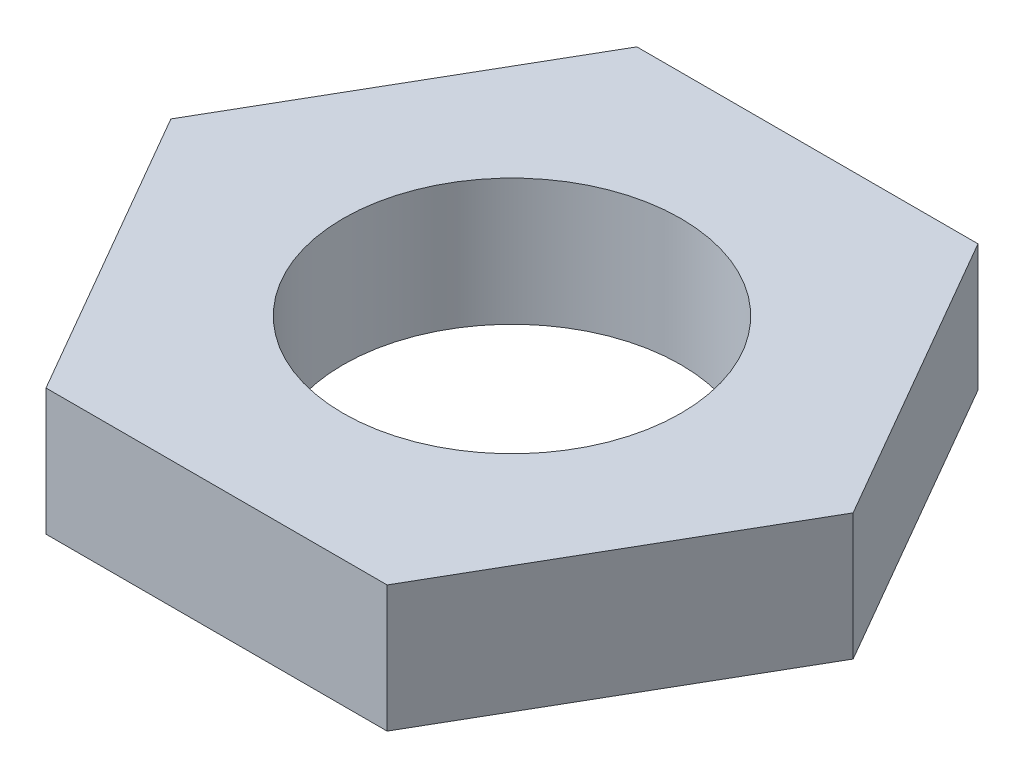
ISO-10303-21;
HEADER;
FILE_DESCRIPTION(('STEP AP214'),'2;1');
FILE_NAME('part.step','',(''),(''),'','','');
FILE_SCHEMA(('AUTOMOTIVE_DESIGN { 1 0 10303 214 1 1 1 1 }'));
ENDSEC;
DATA;
#1=APPLICATION_CONTEXT('core data for automotive mechanical design processes');
#2=APPLICATION_PROTOCOL_DEFINITION('international standard','automotive_design',2000,#1);
#3=PRODUCT_CONTEXT('',#1,'mechanical');
#4=PRODUCT('Part','Part','',(#3));
#5=PRODUCT_RELATED_PRODUCT_CATEGORY('part','',(#4));
#6=PRODUCT_DEFINITION_FORMATION('','',#4);
#7=PRODUCT_DEFINITION_CONTEXT('part definition',#1,'design');
#8=PRODUCT_DEFINITION('design','',#6,#7);
#9=PRODUCT_DEFINITION_SHAPE('','',#8);
#10=(LENGTH_UNIT() NAMED_UNIT(*) SI_UNIT(.MILLI.,.METRE.));
#11=(NAMED_UNIT(*) PLANE_ANGLE_UNIT() SI_UNIT($,.RADIAN.));
#12=(NAMED_UNIT(*) SI_UNIT($,.STERADIAN.) SOLID_ANGLE_UNIT());
#13=UNCERTAINTY_MEASURE_WITH_UNIT(LENGTH_MEASURE(1.E-05),#10,'distance_accuracy_value','');
#14=(GEOMETRIC_REPRESENTATION_CONTEXT(3) GLOBAL_UNCERTAINTY_ASSIGNED_CONTEXT((#13)) GLOBAL_UNIT_ASSIGNED_CONTEXT((#10,
#11,#12)) REPRESENTATION_CONTEXT('',''));
#15=CARTESIAN_POINT('',(0.,0.,0.));
#16=DIRECTION('',(0.,0.,1.));
#17=DIRECTION('',(1.,0.,0.));
#18=AXIS2_PLACEMENT_3D('',#15,#16,#17);
#19=CARTESIAN_POINT('',(0.,15.,0.));
#20=DIRECTION('',(0.,1.,0.));
#21=DIRECTION('',(0.,0.,1.));
#22=AXIS2_PLACEMENT_3D('',#19,#20,#21);
#23=PLANE('',#22);
#24=DIRECTION('',(-1.,0.,0.));
#25=VECTOR('',#24,1.);
#26=CARTESIAN_POINT('',(20.2072594216369,15.,-35.));
#27=LINE('',#26,#25);
#28=CARTESIAN_POINT('',(20.2072594216369,15.,-35.));
#29=VERTEX_POINT('',#28);
#30=CARTESIAN_POINT('',(-20.2072594216369,15.,-35.));
#31=VERTEX_POINT('',#30);
#32=EDGE_CURVE('E131',#29,#31,#27,.T.);
#33=ORIENTED_EDGE('',*,*,#32,.T.);
#34=DIRECTION('',(-0.5,0.,0.866025403784439));
#35=VECTOR('',#34,1.);
#36=CARTESIAN_POINT('',(-20.2072594216369,15.,-35.));
#37=LINE('',#36,#35);
#38=CARTESIAN_POINT('',(-40.4145188432738,15.,0.));
#39=VERTEX_POINT('',#38);
#40=EDGE_CURVE('E89',#31,#39,#37,.T.);
#41=ORIENTED_EDGE('',*,*,#40,.T.);
#42=DIRECTION('',(0.5,0.,0.866025403784438));
#43=VECTOR('',#42,1.);
#44=CARTESIAN_POINT('',(-40.4145188432738,15.,0.));
#45=LINE('',#44,#43);
#46=CARTESIAN_POINT('',(-20.2072594216369,15.,35.));
#47=VERTEX_POINT('',#46);
#48=EDGE_CURVE('E102',#39,#47,#45,.T.);
#49=ORIENTED_EDGE('',*,*,#48,.T.);
#50=DIRECTION('',(1.,0.,0.));
#51=VECTOR('',#50,1.);
#52=CARTESIAN_POINT('',(-20.2072594216369,15.,35.));
#53=LINE('',#52,#51);
#54=CARTESIAN_POINT('',(20.2072594216369,15.,35.));
#55=VERTEX_POINT('',#54);
#56=EDGE_CURVE('E96',#47,#55,#53,.T.);
#57=ORIENTED_EDGE('',*,*,#56,.T.);
#58=DIRECTION('',(0.5,0.,-0.866025403784439));
#59=VECTOR('',#58,1.);
#60=CARTESIAN_POINT('',(20.2072594216369,15.,35.));
#61=LINE('',#60,#59);
#62=CARTESIAN_POINT('',(40.4145188432738,15.,0.));
#63=VERTEX_POINT('',#62);
#64=EDGE_CURVE('E100',#55,#63,#61,.T.);
#65=ORIENTED_EDGE('',*,*,#64,.T.);
#66=DIRECTION('',(-0.5,0.,-0.866025403784438));
#67=VECTOR('',#66,1.);
#68=CARTESIAN_POINT('',(40.4145188432738,15.,0.));
#69=LINE('',#68,#67);
#70=EDGE_CURVE('E52',#63,#29,#69,.T.);
#71=ORIENTED_EDGE('',*,*,#70,.T.);
#72=EDGE_LOOP('',(#33,#41,#49,#57,#65,#71));
#73=FACE_BOUND('',#72,.T.);
#74=CARTESIAN_POINT('',(0.,15.,0.));
#75=DIRECTION('',(0.,1.,0.));
#76=DIRECTION('',(0.,0.,1.));
#77=AXIS2_PLACEMENT_3D('',#74,#75,#76);
#78=CIRCLE('',#77,20.);
#79=CARTESIAN_POINT('',(0.,15.,20.));
#80=VERTEX_POINT('',#79);
#81=EDGE_CURVE('E124',#80,#80,#78,.T.);
#82=ORIENTED_EDGE('',*,*,#81,.F.);
#83=EDGE_LOOP('',(#82));
#84=FACE_BOUND('',#83,.T.);
#85=ADVANCED_FACE('F35',(#73,#84),#23,.T.);
#86=CARTESIAN_POINT('',(0.,0.,0.));
#87=DIRECTION('',(0.,1.,0.));
#88=DIRECTION('',(0.,0.,1.));
#89=AXIS2_PLACEMENT_3D('',#86,#87,#88);
#90=PLANE('',#89);
#91=DIRECTION('',(-1.,0.,0.));
#92=VECTOR('',#91,1.);
#93=CARTESIAN_POINT('',(20.2072594216369,0.,-35.));
#94=LINE('',#93,#92);
#95=CARTESIAN_POINT('',(20.2072594216369,0.,-35.));
#96=VERTEX_POINT('',#95);
#97=CARTESIAN_POINT('',(-20.2072594216369,0.,-35.));
#98=VERTEX_POINT('',#97);
#99=EDGE_CURVE('E120',#96,#98,#94,.T.);
#100=ORIENTED_EDGE('',*,*,#99,.F.);
#101=DIRECTION('',(-0.5,0.,-0.866025403784438));
#102=VECTOR('',#101,1.);
#103=CARTESIAN_POINT('',(40.4145188432738,0.,0.));
#104=LINE('',#103,#102);
#105=CARTESIAN_POINT('',(40.4145188432738,0.,0.));
#106=VERTEX_POINT('',#105);
#107=EDGE_CURVE('E81',#106,#96,#104,.T.);
#108=ORIENTED_EDGE('',*,*,#107,.F.);
#109=DIRECTION('',(0.5,0.,-0.866025403784439));
#110=VECTOR('',#109,1.);
#111=CARTESIAN_POINT('',(20.2072594216369,0.,35.));
#112=LINE('',#111,#110);
#113=CARTESIAN_POINT('',(20.2072594216369,0.,35.));
#114=VERTEX_POINT('',#113);
#115=EDGE_CURVE('E75',#114,#106,#112,.T.);
#116=ORIENTED_EDGE('',*,*,#115,.F.);
#117=DIRECTION('',(1.,0.,0.));
#118=VECTOR('',#117,1.);
#119=CARTESIAN_POINT('',(-20.2072594216369,0.,35.));
#120=LINE('',#119,#118);
#121=CARTESIAN_POINT('',(-20.2072594216369,0.,35.));
#122=VERTEX_POINT('',#121);
#123=EDGE_CURVE('E110',#122,#114,#120,.T.);
#124=ORIENTED_EDGE('',*,*,#123,.F.);
#125=DIRECTION('',(0.5,0.,0.866025403784438));
#126=VECTOR('',#125,1.);
#127=CARTESIAN_POINT('',(-40.4145188432738,0.,0.));
#128=LINE('',#127,#126);
#129=CARTESIAN_POINT('',(-40.4145188432738,0.,0.));
#130=VERTEX_POINT('',#129);
#131=EDGE_CURVE('E126',#130,#122,#128,.T.);
#132=ORIENTED_EDGE('',*,*,#131,.F.);
#133=DIRECTION('',(-0.5,0.,0.866025403784439));
#134=VECTOR('',#133,1.);
#135=CARTESIAN_POINT('',(-20.2072594216369,0.,-35.));
#136=LINE('',#135,#134);
#137=EDGE_CURVE('E123',#98,#130,#136,.T.);
#138=ORIENTED_EDGE('',*,*,#137,.F.);
#139=EDGE_LOOP('',(#100,#108,#116,#124,#132,#138));
#140=FACE_BOUND('',#139,.T.);
#141=CARTESIAN_POINT('',(0.,0.,0.));
#142=DIRECTION('',(0.,1.,0.));
#143=DIRECTION('',(0.,0.,1.));
#144=AXIS2_PLACEMENT_3D('',#141,#142,#143);
#145=CIRCLE('',#144,20.);
#146=CARTESIAN_POINT('',(0.,0.,20.));
#147=VERTEX_POINT('',#146);
#148=EDGE_CURVE('E224',#147,#147,#145,.T.);
#149=ORIENTED_EDGE('',*,*,#148,.T.);
#150=EDGE_LOOP('',(#149));
#151=FACE_BOUND('',#150,.T.);
#152=ADVANCED_FACE('F140',(#140,#151),#90,.F.);
#153=CARTESIAN_POINT('',(20.2072594216369,15.,-35.));
#154=DIRECTION('',(0.,0.,1.));
#155=DIRECTION('',(1.,0.,0.));
#156=AXIS2_PLACEMENT_3D('',#153,#154,#155);
#157=PLANE('',#156);
#158=ORIENTED_EDGE('',*,*,#99,.T.);
#159=DIRECTION('',(0.,-1.,0.));
#160=VECTOR('',#159,1.);
#161=CARTESIAN_POINT('',(-20.2072594216369,15.,-35.));
#162=LINE('',#161,#160);
#163=EDGE_CURVE('E11',#31,#98,#162,.T.);
#164=ORIENTED_EDGE('',*,*,#163,.F.);
#165=ORIENTED_EDGE('',*,*,#32,.F.);
#166=DIRECTION('',(0.,-1.,0.));
#167=VECTOR('',#166,1.);
#168=CARTESIAN_POINT('',(20.2072594216369,15.,-35.));
#169=LINE('',#168,#167);
#170=EDGE_CURVE('E116',#29,#96,#169,.T.);
#171=ORIENTED_EDGE('',*,*,#170,.T.);
#172=EDGE_LOOP('',(#158,#164,#165,#171));
#173=FACE_BOUND('',#172,.T.);
#174=ADVANCED_FACE('F37',(#173),#157,.F.);
#175=CARTESIAN_POINT('',(-20.2072594216369,15.,-35.));
#176=DIRECTION('',(0.866025403784439,0.,0.5));
#177=DIRECTION('',(0.5,0.,-0.866025403784439));
#178=AXIS2_PLACEMENT_3D('',#175,#176,#177);
#179=PLANE('',#178);
#180=ORIENTED_EDGE('',*,*,#137,.T.);
#181=DIRECTION('',(0.,-1.,0.));
#182=VECTOR('',#181,1.);
#183=CARTESIAN_POINT('',(-40.4145188432738,15.,0.));
#184=LINE('',#183,#182);
#185=EDGE_CURVE('E44',#39,#130,#184,.T.);
#186=ORIENTED_EDGE('',*,*,#185,.F.);
#187=ORIENTED_EDGE('',*,*,#40,.F.);
#188=ORIENTED_EDGE('',*,*,#163,.T.);
#189=EDGE_LOOP('',(#180,#186,#187,#188));
#190=FACE_BOUND('',#189,.T.);
#191=ADVANCED_FACE('F165',(#190),#179,.F.);
#192=CARTESIAN_POINT('',(-40.4145188432738,15.,0.));
#193=DIRECTION('',(0.866025403784438,0.,-0.5));
#194=DIRECTION('',(-0.5,0.,-0.866025403784439));
#195=AXIS2_PLACEMENT_3D('',#192,#193,#194);
#196=PLANE('',#195);
#197=ORIENTED_EDGE('',*,*,#131,.T.);
#198=DIRECTION('',(0.,-1.,0.));
#199=VECTOR('',#198,1.);
#200=CARTESIAN_POINT('',(-20.2072594216369,15.,35.));
#201=LINE('',#200,#199);
#202=EDGE_CURVE('E111',#47,#122,#201,.T.);
#203=ORIENTED_EDGE('',*,*,#202,.F.);
#204=ORIENTED_EDGE('',*,*,#48,.F.);
#205=ORIENTED_EDGE('',*,*,#185,.T.);
#206=EDGE_LOOP('',(#197,#203,#204,#205));
#207=FACE_BOUND('',#206,.T.);
#208=ADVANCED_FACE('F137',(#207),#196,.F.);
#209=CARTESIAN_POINT('',(-20.2072594216369,15.,35.));
#210=DIRECTION('',(0.,0.,-1.));
#211=DIRECTION('',(-1.,0.,0.));
#212=AXIS2_PLACEMENT_3D('',#209,#210,#211);
#213=PLANE('',#212);
#214=ORIENTED_EDGE('',*,*,#123,.T.);
#215=DIRECTION('',(0.,-1.,0.));
#216=VECTOR('',#215,1.);
#217=CARTESIAN_POINT('',(20.2072594216369,15.,35.));
#218=LINE('',#217,#216);
#219=EDGE_CURVE('E107',#55,#114,#218,.T.);
#220=ORIENTED_EDGE('',*,*,#219,.F.);
#221=ORIENTED_EDGE('',*,*,#56,.F.);
#222=ORIENTED_EDGE('',*,*,#202,.T.);
#223=EDGE_LOOP('',(#214,#220,#221,#222));
#224=FACE_BOUND('',#223,.T.);
#225=ADVANCED_FACE('F108',(#224),#213,.F.);
#226=CARTESIAN_POINT('',(20.2072594216369,15.,35.));
#227=DIRECTION('',(-0.866025403784439,0.,-0.5));
#228=DIRECTION('',(-0.5,0.,0.866025403784439));
#229=AXIS2_PLACEMENT_3D('',#226,#227,#228);
#230=PLANE('',#229);
#231=ORIENTED_EDGE('',*,*,#115,.T.);
#232=DIRECTION('',(0.,-1.,0.));
#233=VECTOR('',#232,1.);
#234=CARTESIAN_POINT('',(40.4145188432738,15.,0.));
#235=LINE('',#234,#233);
#236=EDGE_CURVE('E112',#63,#106,#235,.T.);
#237=ORIENTED_EDGE('',*,*,#236,.F.);
#238=ORIENTED_EDGE('',*,*,#64,.F.);
#239=ORIENTED_EDGE('',*,*,#219,.T.);
#240=EDGE_LOOP('',(#231,#237,#238,#239));
#241=FACE_BOUND('',#240,.T.);
#242=ADVANCED_FACE('F114',(#241),#230,.F.);
#243=CARTESIAN_POINT('',(40.4145188432738,15.,0.));
#244=DIRECTION('',(-0.866025403784439,0.,0.5));
#245=DIRECTION('',(0.5,0.,0.866025403784439));
#246=AXIS2_PLACEMENT_3D('',#243,#244,#245);
#247=PLANE('',#246);
#248=ORIENTED_EDGE('',*,*,#107,.T.);
#249=ORIENTED_EDGE('',*,*,#170,.F.);
#250=ORIENTED_EDGE('',*,*,#70,.F.);
#251=ORIENTED_EDGE('',*,*,#236,.T.);
#252=EDGE_LOOP('',(#248,#249,#250,#251));
#253=FACE_BOUND('',#252,.T.);
#254=ADVANCED_FACE('F145',(#253),#247,.F.);
#255=CARTESIAN_POINT('',(0.,15.,0.));
#256=DIRECTION('',(0.,-1.,0.));
#257=DIRECTION('',(0.,0.,-1.));
#258=AXIS2_PLACEMENT_3D('',#255,#256,#257);
#259=CYLINDRICAL_SURFACE('',#258,20.);
#260=ORIENTED_EDGE('',*,*,#81,.T.);
#261=EDGE_LOOP('',(#260));
#262=FACE_BOUND('',#261,.T.);
#263=ORIENTED_EDGE('',*,*,#148,.F.);
#264=EDGE_LOOP('',(#263));
#265=FACE_BOUND('',#264,.T.);
#266=ADVANCED_FACE('F147',(#262,#265),#259,.F.);
#267=CLOSED_SHELL('',(#85,#152,#174,#191,#208,#225,#242,#254,#266));
#268=MANIFOLD_SOLID_BREP('B2',#267);
#269=ADVANCED_BREP_SHAPE_REPRESENTATION('',(#18,#268),#14);
#270=SHAPE_DEFINITION_REPRESENTATION(#9,#269);
ENDSEC;
END-ISO-10303-21;
